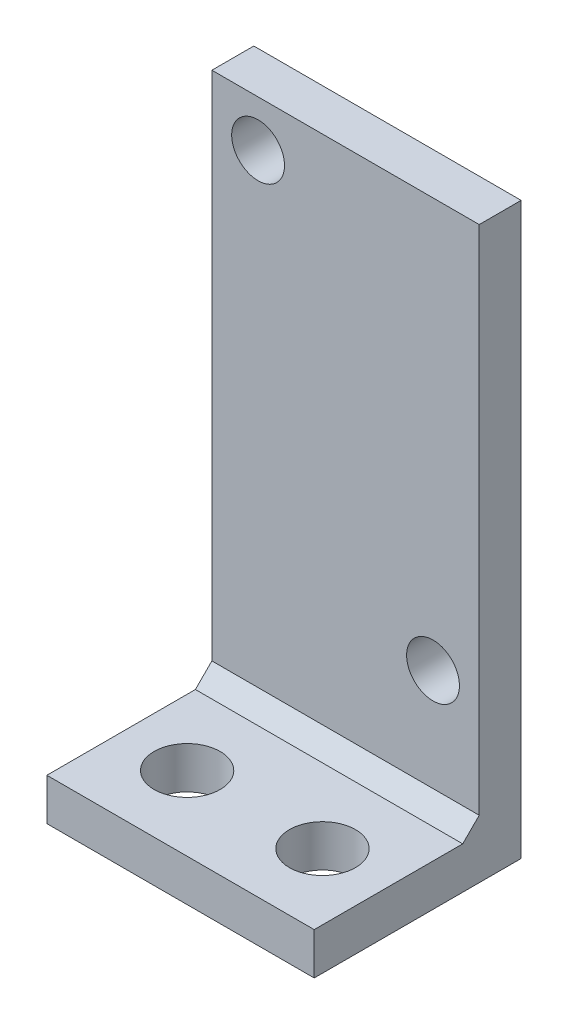
ISO-10303-21;
HEADER;
FILE_DESCRIPTION(('STEP AP214'),'2;1');
FILE_NAME('part.step','',(''),(''),'','','');
FILE_SCHEMA(('AUTOMOTIVE_DESIGN { 1 0 10303 214 1 1 1 1 }'));
ENDSEC;
DATA;
#1=APPLICATION_CONTEXT('core data for automotive mechanical design processes');
#2=APPLICATION_PROTOCOL_DEFINITION('international standard','automotive_design',2000,#1);
#3=PRODUCT_CONTEXT('',#1,'mechanical');
#4=PRODUCT('Part','Part','',(#3));
#5=PRODUCT_RELATED_PRODUCT_CATEGORY('part','',(#4));
#6=PRODUCT_DEFINITION_FORMATION('','',#4);
#7=PRODUCT_DEFINITION_CONTEXT('part definition',#1,'design');
#8=PRODUCT_DEFINITION('design','',#6,#7);
#9=PRODUCT_DEFINITION_SHAPE('','',#8);
#10=(LENGTH_UNIT() NAMED_UNIT(*) SI_UNIT(.MILLI.,.METRE.));
#11=(NAMED_UNIT(*) PLANE_ANGLE_UNIT() SI_UNIT($,.RADIAN.));
#12=(NAMED_UNIT(*) SI_UNIT($,.STERADIAN.) SOLID_ANGLE_UNIT());
#13=UNCERTAINTY_MEASURE_WITH_UNIT(LENGTH_MEASURE(1.E-05),#10,'distance_accuracy_value','');
#14=(GEOMETRIC_REPRESENTATION_CONTEXT(3) GLOBAL_UNCERTAINTY_ASSIGNED_CONTEXT((#13)) GLOBAL_UNIT_ASSIGNED_CONTEXT((#10,
#11,#12)) REPRESENTATION_CONTEXT('',''));
#15=CARTESIAN_POINT('',(0.,0.,0.));
#16=DIRECTION('',(0.,0.,1.));
#17=DIRECTION('',(1.,0.,0.));
#18=AXIS2_PLACEMENT_3D('',#15,#16,#17);
#19=CARTESIAN_POINT('',(0.,0.,2.54));
#20=DIRECTION('',(0.,0.,-1.));
#21=DIRECTION('',(-1.,0.,0.));
#22=AXIS2_PLACEMENT_3D('',#19,#20,#21);
#23=PLANE('',#22);
#24=CARTESIAN_POINT('',(2.8,31.74,2.54));
#25=DIRECTION('',(0.,0.,-1.));
#26=DIRECTION('',(1.,0.,0.));
#27=AXIS2_PLACEMENT_3D('',#24,#25,#26);
#28=CIRCLE('',#27,1.6);
#29=CARTESIAN_POINT('',(4.4,31.74,2.54));
#30=VERTEX_POINT('',#29);
#31=EDGE_CURVE('E224',#30,#30,#28,.T.);
#32=ORIENTED_EDGE('',*,*,#31,.T.);
#33=EDGE_LOOP('',(#32));
#34=FACE_BOUND('',#33,.T.);
#35=CARTESIAN_POINT('',(13.4,9.74000000000001,2.54));
#36=DIRECTION('',(0.,0.,-1.));
#37=DIRECTION('',(1.,0.,0.));
#38=AXIS2_PLACEMENT_3D('',#35,#36,#37);
#39=CIRCLE('',#38,1.6);
#40=CARTESIAN_POINT('',(15.,9.74000000000001,2.54));
#41=VERTEX_POINT('',#40);
#42=EDGE_CURVE('E115',#41,#41,#39,.T.);
#43=ORIENTED_EDGE('',*,*,#42,.T.);
#44=EDGE_LOOP('',(#43));
#45=FACE_BOUND('',#44,.T.);
#46=DIRECTION('',(0.,-1.,0.));
#47=VECTOR('',#46,1.);
#48=CARTESIAN_POINT('',(0.,0.,2.54));
#49=LINE('',#48,#47);
#50=CARTESIAN_POINT('',(0.,34.54,2.54));
#51=VERTEX_POINT('',#50);
#52=CARTESIAN_POINT('',(0.,3.54,2.54));
#53=VERTEX_POINT('',#52);
#54=EDGE_CURVE('E129',#51,#53,#49,.T.);
#55=ORIENTED_EDGE('',*,*,#54,.T.);
#56=DIRECTION('',(1.,0.,0.));
#57=VECTOR('',#56,1.);
#58=CARTESIAN_POINT('',(16.2,3.54,2.54));
#59=LINE('',#58,#57);
#60=CARTESIAN_POINT('',(16.2,3.54,2.54));
#61=VERTEX_POINT('',#60);
#62=EDGE_CURVE('E54',#53,#61,#59,.T.);
#63=ORIENTED_EDGE('',*,*,#62,.T.);
#64=DIRECTION('',(0.,1.,0.));
#65=VECTOR('',#64,1.);
#66=CARTESIAN_POINT('',(16.2,0.,2.54));
#67=LINE('',#66,#65);
#68=CARTESIAN_POINT('',(16.2,34.54,2.54));
#69=VERTEX_POINT('',#68);
#70=EDGE_CURVE('E131',#61,#69,#67,.T.);
#71=ORIENTED_EDGE('',*,*,#70,.T.);
#72=DIRECTION('',(-1.,0.,0.));
#73=VECTOR('',#72,1.);
#74=CARTESIAN_POINT('',(0.,34.54,2.54));
#75=LINE('',#74,#73);
#76=EDGE_CURVE('E134',#69,#51,#75,.T.);
#77=ORIENTED_EDGE('',*,*,#76,.T.);
#78=EDGE_LOOP('',(#55,#63,#71,#77));
#79=FACE_BOUND('',#78,.T.);
#80=ADVANCED_FACE('F33',(#34,#45,#79),#23,.F.);
#81=CARTESIAN_POINT('',(0.,0.,2.54));
#82=DIRECTION('',(1.,0.,0.));
#83=DIRECTION('',(0.,0.,-1.));
#84=AXIS2_PLACEMENT_3D('',#81,#82,#83);
#85=PLANE('',#84);
#86=DIRECTION('',(0.,-1.,0.));
#87=VECTOR('',#86,1.);
#88=CARTESIAN_POINT('',(0.,0.,0.));
#89=LINE('',#88,#87);
#90=CARTESIAN_POINT('',(0.,34.54,0.));
#91=VERTEX_POINT('',#90);
#92=CARTESIAN_POINT('',(0.,0.,0.));
#93=VERTEX_POINT('',#92);
#94=EDGE_CURVE('E98',#91,#93,#89,.T.);
#95=ORIENTED_EDGE('',*,*,#94,.T.);
#96=DIRECTION('',(0.,0.,-1.));
#97=VECTOR('',#96,1.);
#98=CARTESIAN_POINT('',(0.,0.,2.54));
#99=LINE('',#98,#97);
#100=CARTESIAN_POINT('',(0.,0.,12.54));
#101=VERTEX_POINT('',#100);
#102=EDGE_CURVE('E91',#101,#93,#99,.T.);
#103=ORIENTED_EDGE('',*,*,#102,.F.);
#104=DIRECTION('',(0.,-1.,0.));
#105=VECTOR('',#104,1.);
#106=CARTESIAN_POINT('',(0.,0.,12.54));
#107=LINE('',#106,#105);
#108=CARTESIAN_POINT('',(0.,2.54,12.54));
#109=VERTEX_POINT('',#108);
#110=EDGE_CURVE('E95',#109,#101,#107,.T.);
#111=ORIENTED_EDGE('',*,*,#110,.F.);
#112=DIRECTION('',(0.,0.,-1.));
#113=VECTOR('',#112,1.);
#114=CARTESIAN_POINT('',(0.,2.54,12.54));
#115=LINE('',#114,#113);
#116=CARTESIAN_POINT('',(0.,2.54,3.54000000000001));
#117=VERTEX_POINT('',#116);
#118=EDGE_CURVE('E124',#109,#117,#115,.T.);
#119=ORIENTED_EDGE('',*,*,#118,.T.);
#120=DIRECTION('',(0.,-0.707106781186544,0.707106781186551));
#121=VECTOR('',#120,1.);
#122=CARTESIAN_POINT('',(0.,1.77000000000002,4.31));
#123=LINE('',#122,#121);
#124=EDGE_CURVE('E41',#117,#53,#123,.F.);
#125=ORIENTED_EDGE('',*,*,#124,.T.);
#126=ORIENTED_EDGE('',*,*,#54,.F.);
#127=DIRECTION('',(0.,0.,-1.));
#128=VECTOR('',#127,1.);
#129=CARTESIAN_POINT('',(0.,34.54,2.54));
#130=LINE('',#129,#128);
#131=EDGE_CURVE('E136',#51,#91,#130,.T.);
#132=ORIENTED_EDGE('',*,*,#131,.T.);
#133=EDGE_LOOP('',(#95,#103,#111,#119,#125,#126,#132));
#134=FACE_BOUND('',#133,.T.);
#135=ADVANCED_FACE('F93',(#134),#85,.F.);
#136=CARTESIAN_POINT('',(0.,0.,2.54));
#137=DIRECTION('',(0.,1.,0.));
#138=DIRECTION('',(0.,0.,1.));
#139=AXIS2_PLACEMENT_3D('',#136,#137,#138);
#140=PLANE('',#139);
#141=CARTESIAN_POINT('',(4.,0.,8.04000000000001));
#142=DIRECTION('',(0.,1.,0.));
#143=DIRECTION('',(0.,0.,1.));
#144=AXIS2_PLACEMENT_3D('',#141,#142,#143);
#145=CIRCLE('',#144,2.);
#146=CARTESIAN_POINT('',(4.,0.,10.04));
#147=VERTEX_POINT('',#146);
#148=EDGE_CURVE('E210',#147,#147,#145,.T.);
#149=ORIENTED_EDGE('',*,*,#148,.T.);
#150=EDGE_LOOP('',(#149));
#151=FACE_BOUND('',#150,.T.);
#152=CARTESIAN_POINT('',(12.2,0.,8.04000000000001));
#153=DIRECTION('',(0.,1.,0.));
#154=DIRECTION('',(0.,0.,1.));
#155=AXIS2_PLACEMENT_3D('',#152,#153,#154);
#156=CIRCLE('',#155,2.);
#157=CARTESIAN_POINT('',(12.2,0.,10.04));
#158=VERTEX_POINT('',#157);
#159=EDGE_CURVE('E218',#158,#158,#156,.T.);
#160=ORIENTED_EDGE('',*,*,#159,.T.);
#161=EDGE_LOOP('',(#160));
#162=FACE_BOUND('',#161,.T.);
#163=DIRECTION('',(1.,0.,0.));
#164=VECTOR('',#163,1.);
#165=CARTESIAN_POINT('',(0.,0.,0.));
#166=LINE('',#165,#164);
#167=CARTESIAN_POINT('',(16.2,0.,0.));
#168=VERTEX_POINT('',#167);
#169=EDGE_CURVE('E138',#93,#168,#166,.T.);
#170=ORIENTED_EDGE('',*,*,#169,.T.);
#171=DIRECTION('',(0.,0.,-1.));
#172=VECTOR('',#171,1.);
#173=CARTESIAN_POINT('',(16.2,0.,2.54));
#174=LINE('',#173,#172);
#175=CARTESIAN_POINT('',(16.2,0.,12.54));
#176=VERTEX_POINT('',#175);
#177=EDGE_CURVE('E101',#176,#168,#174,.T.);
#178=ORIENTED_EDGE('',*,*,#177,.F.);
#179=DIRECTION('',(1.,0.,0.));
#180=VECTOR('',#179,1.);
#181=CARTESIAN_POINT('',(0.,0.,12.54));
#182=LINE('',#181,#180);
#183=EDGE_CURVE('E104',#101,#176,#182,.T.);
#184=ORIENTED_EDGE('',*,*,#183,.F.);
#185=ORIENTED_EDGE('',*,*,#102,.T.);
#186=EDGE_LOOP('',(#170,#178,#184,#185));
#187=FACE_BOUND('',#186,.T.);
#188=ADVANCED_FACE('F105',(#151,#162,#187),#140,.F.);
#189=CARTESIAN_POINT('',(16.2,0.,2.54));
#190=DIRECTION('',(-1.,0.,0.));
#191=DIRECTION('',(0.,0.,1.));
#192=AXIS2_PLACEMENT_3D('',#189,#190,#191);
#193=PLANE('',#192);
#194=DIRECTION('',(0.,1.,0.));
#195=VECTOR('',#194,1.);
#196=CARTESIAN_POINT('',(16.2,0.,0.));
#197=LINE('',#196,#195);
#198=CARTESIAN_POINT('',(16.2,34.54,0.));
#199=VERTEX_POINT('',#198);
#200=EDGE_CURVE('E140',#168,#199,#197,.T.);
#201=ORIENTED_EDGE('',*,*,#200,.T.);
#202=DIRECTION('',(0.,0.,-1.));
#203=VECTOR('',#202,1.);
#204=CARTESIAN_POINT('',(16.2,34.54,2.54));
#205=LINE('',#204,#203);
#206=EDGE_CURVE('E144',#69,#199,#205,.T.);
#207=ORIENTED_EDGE('',*,*,#206,.F.);
#208=ORIENTED_EDGE('',*,*,#70,.F.);
#209=DIRECTION('',(0.,0.707106781186544,-0.707106781186551));
#210=VECTOR('',#209,1.);
#211=CARTESIAN_POINT('',(16.2,1.77000000000002,4.31));
#212=LINE('',#211,#210);
#213=CARTESIAN_POINT('',(16.2,2.54,3.54000000000001));
#214=VERTEX_POINT('',#213);
#215=EDGE_CURVE('E11',#61,#214,#212,.F.);
#216=ORIENTED_EDGE('',*,*,#215,.T.);
#217=DIRECTION('',(0.,0.,-1.));
#218=VECTOR('',#217,1.);
#219=CARTESIAN_POINT('',(16.2,2.54,12.54));
#220=LINE('',#219,#218);
#221=CARTESIAN_POINT('',(16.2,2.54,12.54));
#222=VERTEX_POINT('',#221);
#223=EDGE_CURVE('E126',#222,#214,#220,.T.);
#224=ORIENTED_EDGE('',*,*,#223,.F.);
#225=DIRECTION('',(0.,1.,0.));
#226=VECTOR('',#225,1.);
#227=CARTESIAN_POINT('',(16.2,0.,12.54));
#228=LINE('',#227,#226);
#229=EDGE_CURVE('E109',#176,#222,#228,.T.);
#230=ORIENTED_EDGE('',*,*,#229,.F.);
#231=ORIENTED_EDGE('',*,*,#177,.T.);
#232=EDGE_LOOP('',(#201,#207,#208,#216,#224,#230,#231));
#233=FACE_BOUND('',#232,.T.);
#234=ADVANCED_FACE('F157',(#233),#193,.F.);
#235=CARTESIAN_POINT('',(0.,34.54,2.54));
#236=DIRECTION('',(0.,-1.,0.));
#237=DIRECTION('',(0.,0.,-1.));
#238=AXIS2_PLACEMENT_3D('',#235,#236,#237);
#239=PLANE('',#238);
#240=DIRECTION('',(-1.,0.,0.));
#241=VECTOR('',#240,1.);
#242=CARTESIAN_POINT('',(0.,34.54,0.));
#243=LINE('',#242,#241);
#244=EDGE_CURVE('E132',#199,#91,#243,.T.);
#245=ORIENTED_EDGE('',*,*,#244,.T.);
#246=ORIENTED_EDGE('',*,*,#131,.F.);
#247=ORIENTED_EDGE('',*,*,#76,.F.);
#248=ORIENTED_EDGE('',*,*,#206,.T.);
#249=EDGE_LOOP('',(#245,#246,#247,#248));
#250=FACE_BOUND('',#249,.T.);
#251=ADVANCED_FACE('F162',(#250),#239,.F.);
#252=CARTESIAN_POINT('',(0.,0.,0.));
#253=DIRECTION('',(0.,0.,-1.));
#254=DIRECTION('',(-1.,0.,0.));
#255=AXIS2_PLACEMENT_3D('',#252,#253,#254);
#256=PLANE('',#255);
#257=CARTESIAN_POINT('',(2.8,31.74,0.));
#258=DIRECTION('',(0.,0.,-1.));
#259=DIRECTION('',(1.,0.,0.));
#260=AXIS2_PLACEMENT_3D('',#257,#258,#259);
#261=CIRCLE('',#260,1.6);
#262=CARTESIAN_POINT('',(4.4,31.74,0.));
#263=VERTEX_POINT('',#262);
#264=EDGE_CURVE('E221',#263,#263,#261,.T.);
#265=ORIENTED_EDGE('',*,*,#264,.F.);
#266=EDGE_LOOP('',(#265));
#267=FACE_BOUND('',#266,.T.);
#268=CARTESIAN_POINT('',(13.4,9.74000000000001,0.));
#269=DIRECTION('',(0.,0.,-1.));
#270=DIRECTION('',(1.,0.,0.));
#271=AXIS2_PLACEMENT_3D('',#268,#269,#270);
#272=CIRCLE('',#271,1.6);
#273=CARTESIAN_POINT('',(15.,9.74000000000001,0.));
#274=VERTEX_POINT('',#273);
#275=EDGE_CURVE('E118',#274,#274,#272,.T.);
#276=ORIENTED_EDGE('',*,*,#275,.F.);
#277=EDGE_LOOP('',(#276));
#278=FACE_BOUND('',#277,.T.);
#279=ORIENTED_EDGE('',*,*,#94,.F.);
#280=ORIENTED_EDGE('',*,*,#244,.F.);
#281=ORIENTED_EDGE('',*,*,#200,.F.);
#282=ORIENTED_EDGE('',*,*,#169,.F.);
#283=EDGE_LOOP('',(#279,#280,#281,#282));
#284=FACE_BOUND('',#283,.T.);
#285=ADVANCED_FACE('F165',(#267,#278,#284),#256,.T.);
#286=CARTESIAN_POINT('',(0.,2.54,12.54));
#287=DIRECTION('',(0.,-1.,0.));
#288=DIRECTION('',(0.,0.,-1.));
#289=AXIS2_PLACEMENT_3D('',#286,#287,#288);
#290=PLANE('',#289);
#291=CARTESIAN_POINT('',(4.,2.54,8.04000000000001));
#292=DIRECTION('',(0.,1.,0.));
#293=DIRECTION('',(0.,0.,1.));
#294=AXIS2_PLACEMENT_3D('',#291,#292,#293);
#295=CIRCLE('',#294,2.);
#296=CARTESIAN_POINT('',(4.,2.54,10.04));
#297=VERTEX_POINT('',#296);
#298=EDGE_CURVE('E213',#297,#297,#295,.T.);
#299=ORIENTED_EDGE('',*,*,#298,.F.);
#300=EDGE_LOOP('',(#299));
#301=FACE_BOUND('',#300,.T.);
#302=CARTESIAN_POINT('',(12.2,2.54,8.04000000000001));
#303=DIRECTION('',(0.,1.,0.));
#304=DIRECTION('',(0.,0.,1.));
#305=AXIS2_PLACEMENT_3D('',#302,#303,#304);
#306=CIRCLE('',#305,2.);
#307=CARTESIAN_POINT('',(12.2,2.54,10.04));
#308=VERTEX_POINT('',#307);
#309=EDGE_CURVE('E215',#308,#308,#306,.T.);
#310=ORIENTED_EDGE('',*,*,#309,.F.);
#311=EDGE_LOOP('',(#310));
#312=FACE_BOUND('',#311,.T.);
#313=ORIENTED_EDGE('',*,*,#223,.T.);
#314=DIRECTION('',(-1.,0.,0.));
#315=VECTOR('',#314,1.);
#316=CARTESIAN_POINT('',(0.,2.54,3.54000000000001));
#317=LINE('',#316,#315);
#318=EDGE_CURVE('E100',#214,#117,#317,.T.);
#319=ORIENTED_EDGE('',*,*,#318,.T.);
#320=ORIENTED_EDGE('',*,*,#118,.F.);
#321=DIRECTION('',(-1.,0.,0.));
#322=VECTOR('',#321,1.);
#323=CARTESIAN_POINT('',(0.,2.54,12.54));
#324=LINE('',#323,#322);
#325=EDGE_CURVE('E113',#222,#109,#324,.T.);
#326=ORIENTED_EDGE('',*,*,#325,.F.);
#327=EDGE_LOOP('',(#313,#319,#320,#326));
#328=FACE_BOUND('',#327,.T.);
#329=ADVANCED_FACE('F152',(#301,#312,#328),#290,.F.);
#330=CARTESIAN_POINT('',(0.,0.,12.54));
#331=DIRECTION('',(0.,0.,-1.));
#332=DIRECTION('',(-1.,0.,0.));
#333=AXIS2_PLACEMENT_3D('',#330,#331,#332);
#334=PLANE('',#333);
#335=ORIENTED_EDGE('',*,*,#110,.T.);
#336=ORIENTED_EDGE('',*,*,#183,.T.);
#337=ORIENTED_EDGE('',*,*,#229,.T.);
#338=ORIENTED_EDGE('',*,*,#325,.T.);
#339=EDGE_LOOP('',(#335,#336,#337,#338));
#340=FACE_BOUND('',#339,.T.);
#341=ADVANCED_FACE('F111',(#340),#334,.F.);
#342=CARTESIAN_POINT('',(0.,2.54,3.54000000000001));
#343=DIRECTION('',(0.,0.707106781186551,0.707106781186544));
#344=DIRECTION('',(1.,0.,0.));
#345=AXIS2_PLACEMENT_3D('',#342,#343,#344);
#346=PLANE('',#345);
#347=ORIENTED_EDGE('',*,*,#215,.F.);
#348=ORIENTED_EDGE('',*,*,#62,.F.);
#349=ORIENTED_EDGE('',*,*,#124,.F.);
#350=ORIENTED_EDGE('',*,*,#318,.F.);
#351=EDGE_LOOP('',(#347,#348,#349,#350));
#352=FACE_BOUND('',#351,.T.);
#353=ADVANCED_FACE('F35',(#352),#346,.T.);
#354=CARTESIAN_POINT('',(13.4,9.74000000000001,2.54));
#355=DIRECTION('',(0.,0.,-1.));
#356=DIRECTION('',(-1.,0.,0.));
#357=AXIS2_PLACEMENT_3D('',#354,#355,#356);
#358=CYLINDRICAL_SURFACE('',#357,1.6);
#359=ORIENTED_EDGE('',*,*,#42,.F.);
#360=EDGE_LOOP('',(#359));
#361=FACE_BOUND('',#360,.T.);
#362=ORIENTED_EDGE('',*,*,#275,.T.);
#363=EDGE_LOOP('',(#362));
#364=FACE_BOUND('',#363,.T.);
#365=ADVANCED_FACE('F190',(#361,#364),#358,.F.);
#366=CARTESIAN_POINT('',(2.8,31.74,2.54));
#367=DIRECTION('',(0.,0.,-1.));
#368=DIRECTION('',(-1.,0.,0.));
#369=AXIS2_PLACEMENT_3D('',#366,#367,#368);
#370=CYLINDRICAL_SURFACE('',#369,1.6);
#371=ORIENTED_EDGE('',*,*,#31,.F.);
#372=EDGE_LOOP('',(#371));
#373=FACE_BOUND('',#372,.T.);
#374=ORIENTED_EDGE('',*,*,#264,.T.);
#375=EDGE_LOOP('',(#374));
#376=FACE_BOUND('',#375,.T.);
#377=ADVANCED_FACE('F193',(#373,#376),#370,.F.);
#378=CARTESIAN_POINT('',(12.2,0.,8.04000000000001));
#379=DIRECTION('',(0.,1.,0.));
#380=DIRECTION('',(0.,0.,1.));
#381=AXIS2_PLACEMENT_3D('',#378,#379,#380);
#382=CYLINDRICAL_SURFACE('',#381,2.);
#383=ORIENTED_EDGE('',*,*,#159,.F.);
#384=EDGE_LOOP('',(#383));
#385=FACE_BOUND('',#384,.T.);
#386=ORIENTED_EDGE('',*,*,#309,.T.);
#387=EDGE_LOOP('',(#386));
#388=FACE_BOUND('',#387,.T.);
#389=ADVANCED_FACE('F197',(#385,#388),#382,.F.);
#390=CARTESIAN_POINT('',(4.,0.,8.04000000000001));
#391=DIRECTION('',(0.,1.,0.));
#392=DIRECTION('',(0.,0.,1.));
#393=AXIS2_PLACEMENT_3D('',#390,#391,#392);
#394=CYLINDRICAL_SURFACE('',#393,2.);
#395=ORIENTED_EDGE('',*,*,#148,.F.);
#396=EDGE_LOOP('',(#395));
#397=FACE_BOUND('',#396,.T.);
#398=ORIENTED_EDGE('',*,*,#298,.T.);
#399=EDGE_LOOP('',(#398));
#400=FACE_BOUND('',#399,.T.);
#401=ADVANCED_FACE('F201',(#397,#400),#394,.F.);
#402=CLOSED_SHELL('',(#80,#135,#188,#234,#251,#285,#329,#341,#353,#365,#377,#389,#401));
#403=MANIFOLD_SOLID_BREP('B2',#402);
#404=ADVANCED_BREP_SHAPE_REPRESENTATION('',(#18,#403),#14);
#405=SHAPE_DEFINITION_REPRESENTATION(#9,#404);
ENDSEC;
END-ISO-10303-21;
